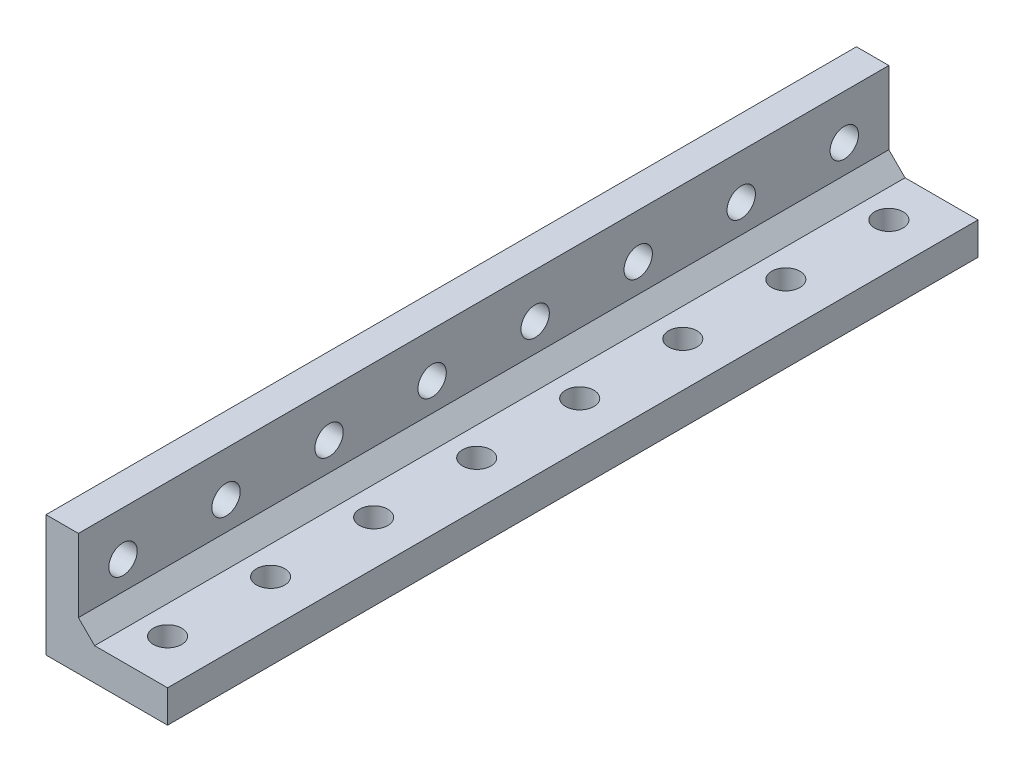
ISO-10303-21;
HEADER;
FILE_DESCRIPTION(('STEP AP214'),'2;1');
FILE_NAME('part.step','',(''),(''),'','','');
FILE_SCHEMA(('AUTOMOTIVE_DESIGN { 1 0 10303 214 1 1 1 1 }'));
ENDSEC;
DATA;
#1=APPLICATION_CONTEXT('core data for automotive mechanical design processes');
#2=APPLICATION_PROTOCOL_DEFINITION('international standard','automotive_design',2000,#1);
#3=PRODUCT_CONTEXT('',#1,'mechanical');
#4=PRODUCT('Part','Part','',(#3));
#5=PRODUCT_RELATED_PRODUCT_CATEGORY('part','',(#4));
#6=PRODUCT_DEFINITION_FORMATION('','',#4);
#7=PRODUCT_DEFINITION_CONTEXT('part definition',#1,'design');
#8=PRODUCT_DEFINITION('design','',#6,#7);
#9=PRODUCT_DEFINITION_SHAPE('','',#8);
#10=(LENGTH_UNIT() NAMED_UNIT(*) SI_UNIT(.MILLI.,.METRE.));
#11=(NAMED_UNIT(*) PLANE_ANGLE_UNIT() SI_UNIT($,.RADIAN.));
#12=(NAMED_UNIT(*) SI_UNIT($,.STERADIAN.) SOLID_ANGLE_UNIT());
#13=UNCERTAINTY_MEASURE_WITH_UNIT(LENGTH_MEASURE(1.E-05),#10,'distance_accuracy_value','');
#14=(GEOMETRIC_REPRESENTATION_CONTEXT(3) GLOBAL_UNCERTAINTY_ASSIGNED_CONTEXT((#13)) GLOBAL_UNIT_ASSIGNED_CONTEXT((#10,
#11,#12)) REPRESENTATION_CONTEXT('',''));
#15=CARTESIAN_POINT('',(0.,0.,0.));
#16=DIRECTION('',(0.,0.,1.));
#17=DIRECTION('',(1.,0.,0.));
#18=AXIS2_PLACEMENT_3D('',#15,#16,#17);
#19=CARTESIAN_POINT('',(9.50000000000002,-96.,5.50000000000001));
#20=DIRECTION('',(0.,1.,0.));
#21=DIRECTION('',(-1.,0.,0.));
#22=AXIS2_PLACEMENT_3D('',#19,#20,#21);
#23=CYLINDRICAL_SURFACE('',#22,1.75);
#24=CARTESIAN_POINT('',(9.5,4.,5.50000000000001));
#25=DIRECTION('',(0.,1.,0.));
#26=DIRECTION('',(-1.,0.,0.));
#27=AXIS2_PLACEMENT_3D('',#24,#25,#26);
#28=CIRCLE('',#27,1.75);
#29=CARTESIAN_POINT('',(7.75,4.,5.50000000000001));
#30=VERTEX_POINT('',#29);
#31=EDGE_CURVE('E226',#30,#30,#28,.T.);
#32=ORIENTED_EDGE('',*,*,#31,.T.);
#33=EDGE_LOOP('',(#32));
#34=FACE_BOUND('',#33,.T.);
#35=CARTESIAN_POINT('',(9.5,0.,5.50000000000001));
#36=DIRECTION('',(0.,1.,0.));
#37=DIRECTION('',(0.,0.,1.));
#38=AXIS2_PLACEMENT_3D('',#35,#36,#37);
#39=CIRCLE('',#38,1.75);
#40=CARTESIAN_POINT('',(9.5,0.,7.25000000000001));
#41=VERTEX_POINT('',#40);
#42=EDGE_CURVE('E230',#41,#41,#39,.T.);
#43=ORIENTED_EDGE('',*,*,#42,.F.);
#44=EDGE_LOOP('',(#43));
#45=FACE_BOUND('',#44,.T.);
#46=ADVANCED_FACE('F39',(#34,#45),#23,.F.);
#47=CARTESIAN_POINT('',(9.50000000000002,-96.,18.2142857142857));
#48=DIRECTION('',(0.,1.,0.));
#49=DIRECTION('',(-1.,0.,0.));
#50=AXIS2_PLACEMENT_3D('',#47,#48,#49);
#51=CYLINDRICAL_SURFACE('',#50,1.75);
#52=CARTESIAN_POINT('',(9.5,4.,18.2142857142857));
#53=DIRECTION('',(0.,1.,0.));
#54=DIRECTION('',(-1.,0.,0.));
#55=AXIS2_PLACEMENT_3D('',#52,#53,#54);
#56=CIRCLE('',#55,1.75);
#57=CARTESIAN_POINT('',(7.75,4.,18.2142857142857));
#58=VERTEX_POINT('',#57);
#59=EDGE_CURVE('E218',#58,#58,#56,.T.);
#60=ORIENTED_EDGE('',*,*,#59,.T.);
#61=EDGE_LOOP('',(#60));
#62=FACE_BOUND('',#61,.T.);
#63=CARTESIAN_POINT('',(9.5,0.,18.2142857142857));
#64=DIRECTION('',(0.,1.,0.));
#65=DIRECTION('',(0.,0.,1.));
#66=AXIS2_PLACEMENT_3D('',#63,#64,#65);
#67=CIRCLE('',#66,1.75);
#68=CARTESIAN_POINT('',(9.5,0.,19.9642857142857));
#69=VERTEX_POINT('',#68);
#70=EDGE_CURVE('E222',#69,#69,#67,.T.);
#71=ORIENTED_EDGE('',*,*,#70,.F.);
#72=EDGE_LOOP('',(#71));
#73=FACE_BOUND('',#72,.T.);
#74=ADVANCED_FACE('F349',(#62,#73),#51,.F.);
#75=CARTESIAN_POINT('',(9.50000000000002,-96.,30.9285714285714));
#76=DIRECTION('',(0.,1.,0.));
#77=DIRECTION('',(-1.,0.,0.));
#78=AXIS2_PLACEMENT_3D('',#75,#76,#77);
#79=CYLINDRICAL_SURFACE('',#78,1.75);
#80=CARTESIAN_POINT('',(9.5,4.,30.9285714285714));
#81=DIRECTION('',(0.,1.,0.));
#82=DIRECTION('',(-1.,0.,0.));
#83=AXIS2_PLACEMENT_3D('',#80,#81,#82);
#84=CIRCLE('',#83,1.75);
#85=CARTESIAN_POINT('',(7.75,4.,30.9285714285714));
#86=VERTEX_POINT('',#85);
#87=EDGE_CURVE('E210',#86,#86,#84,.T.);
#88=ORIENTED_EDGE('',*,*,#87,.T.);
#89=EDGE_LOOP('',(#88));
#90=FACE_BOUND('',#89,.T.);
#91=CARTESIAN_POINT('',(9.5,0.,30.9285714285714));
#92=DIRECTION('',(0.,1.,0.));
#93=DIRECTION('',(0.,0.,1.));
#94=AXIS2_PLACEMENT_3D('',#91,#92,#93);
#95=CIRCLE('',#94,1.75);
#96=CARTESIAN_POINT('',(9.5,0.,32.6785714285714));
#97=VERTEX_POINT('',#96);
#98=EDGE_CURVE('E214',#97,#97,#95,.T.);
#99=ORIENTED_EDGE('',*,*,#98,.F.);
#100=EDGE_LOOP('',(#99));
#101=FACE_BOUND('',#100,.T.);
#102=ADVANCED_FACE('F354',(#90,#101),#79,.F.);
#103=CARTESIAN_POINT('',(9.50000000000002,-96.,43.6428571428571));
#104=DIRECTION('',(0.,1.,0.));
#105=DIRECTION('',(-1.,0.,0.));
#106=AXIS2_PLACEMENT_3D('',#103,#104,#105);
#107=CYLINDRICAL_SURFACE('',#106,1.75);
#108=CARTESIAN_POINT('',(9.5,4.,43.6428571428571));
#109=DIRECTION('',(0.,1.,0.));
#110=DIRECTION('',(-1.,0.,0.));
#111=AXIS2_PLACEMENT_3D('',#108,#109,#110);
#112=CIRCLE('',#111,1.75);
#113=CARTESIAN_POINT('',(7.75,4.,43.6428571428571));
#114=VERTEX_POINT('',#113);
#115=EDGE_CURVE('E202',#114,#114,#112,.T.);
#116=ORIENTED_EDGE('',*,*,#115,.T.);
#117=EDGE_LOOP('',(#116));
#118=FACE_BOUND('',#117,.T.);
#119=CARTESIAN_POINT('',(9.5,0.,43.6428571428571));
#120=DIRECTION('',(0.,1.,0.));
#121=DIRECTION('',(0.,0.,1.));
#122=AXIS2_PLACEMENT_3D('',#119,#120,#121);
#123=CIRCLE('',#122,1.75);
#124=CARTESIAN_POINT('',(9.5,0.,45.3928571428571));
#125=VERTEX_POINT('',#124);
#126=EDGE_CURVE('E206',#125,#125,#123,.T.);
#127=ORIENTED_EDGE('',*,*,#126,.F.);
#128=EDGE_LOOP('',(#127));
#129=FACE_BOUND('',#128,.T.);
#130=ADVANCED_FACE('F361',(#118,#129),#107,.F.);
#131=CARTESIAN_POINT('',(9.50000000000002,-96.,56.3571428571428));
#132=DIRECTION('',(0.,1.,0.));
#133=DIRECTION('',(-1.,0.,0.));
#134=AXIS2_PLACEMENT_3D('',#131,#132,#133);
#135=CYLINDRICAL_SURFACE('',#134,1.75);
#136=CARTESIAN_POINT('',(9.5,4.,56.3571428571428));
#137=DIRECTION('',(0.,1.,0.));
#138=DIRECTION('',(-1.,0.,0.));
#139=AXIS2_PLACEMENT_3D('',#136,#137,#138);
#140=CIRCLE('',#139,1.75);
#141=CARTESIAN_POINT('',(7.75,4.,56.3571428571428));
#142=VERTEX_POINT('',#141);
#143=EDGE_CURVE('E194',#142,#142,#140,.T.);
#144=ORIENTED_EDGE('',*,*,#143,.T.);
#145=EDGE_LOOP('',(#144));
#146=FACE_BOUND('',#145,.T.);
#147=CARTESIAN_POINT('',(9.5,0.,56.3571428571428));
#148=DIRECTION('',(0.,1.,0.));
#149=DIRECTION('',(0.,0.,1.));
#150=AXIS2_PLACEMENT_3D('',#147,#148,#149);
#151=CIRCLE('',#150,1.75);
#152=CARTESIAN_POINT('',(9.5,0.,58.1071428571428));
#153=VERTEX_POINT('',#152);
#154=EDGE_CURVE('E198',#153,#153,#151,.T.);
#155=ORIENTED_EDGE('',*,*,#154,.F.);
#156=EDGE_LOOP('',(#155));
#157=FACE_BOUND('',#156,.T.);
#158=ADVANCED_FACE('F365',(#146,#157),#135,.F.);
#159=CARTESIAN_POINT('',(9.50000000000002,-96.,69.0714285714286));
#160=DIRECTION('',(0.,1.,0.));
#161=DIRECTION('',(-1.,0.,0.));
#162=AXIS2_PLACEMENT_3D('',#159,#160,#161);
#163=CYLINDRICAL_SURFACE('',#162,1.75);
#164=CARTESIAN_POINT('',(9.5,4.,69.0714285714286));
#165=DIRECTION('',(0.,1.,0.));
#166=DIRECTION('',(-1.,0.,0.));
#167=AXIS2_PLACEMENT_3D('',#164,#165,#166);
#168=CIRCLE('',#167,1.75);
#169=CARTESIAN_POINT('',(7.75,4.,69.0714285714286));
#170=VERTEX_POINT('',#169);
#171=EDGE_CURVE('E186',#170,#170,#168,.T.);
#172=ORIENTED_EDGE('',*,*,#171,.T.);
#173=EDGE_LOOP('',(#172));
#174=FACE_BOUND('',#173,.T.);
#175=CARTESIAN_POINT('',(9.5,0.,69.0714285714286));
#176=DIRECTION('',(0.,1.,0.));
#177=DIRECTION('',(0.,0.,1.));
#178=AXIS2_PLACEMENT_3D('',#175,#176,#177);
#179=CIRCLE('',#178,1.75);
#180=CARTESIAN_POINT('',(9.5,0.,70.8214285714286));
#181=VERTEX_POINT('',#180);
#182=EDGE_CURVE('E190',#181,#181,#179,.T.);
#183=ORIENTED_EDGE('',*,*,#182,.F.);
#184=EDGE_LOOP('',(#183));
#185=FACE_BOUND('',#184,.T.);
#186=ADVANCED_FACE('F369',(#174,#185),#163,.F.);
#187=CARTESIAN_POINT('',(-96.,9.5,5.50000000000001));
#188=DIRECTION('',(1.,0.,0.));
#189=DIRECTION('',(0.,0.,-1.));
#190=AXIS2_PLACEMENT_3D('',#187,#188,#189);
#191=CYLINDRICAL_SURFACE('',#190,1.75);
#192=CARTESIAN_POINT('',(4.,9.5,5.50000000000001));
#193=DIRECTION('',(1.,0.,0.));
#194=DIRECTION('',(0.,0.,-1.));
#195=AXIS2_PLACEMENT_3D('',#192,#193,#194);
#196=CIRCLE('',#195,1.75);
#197=CARTESIAN_POINT('',(4.,9.5,3.75000000000001));
#198=VERTEX_POINT('',#197);
#199=EDGE_CURVE('E178',#198,#198,#196,.T.);
#200=ORIENTED_EDGE('',*,*,#199,.T.);
#201=EDGE_LOOP('',(#200));
#202=FACE_BOUND('',#201,.T.);
#203=CARTESIAN_POINT('',(0.,9.5,5.50000000000001));
#204=DIRECTION('',(1.,0.,0.));
#205=DIRECTION('',(0.,0.,-1.));
#206=AXIS2_PLACEMENT_3D('',#203,#204,#205);
#207=CIRCLE('',#206,1.75);
#208=CARTESIAN_POINT('',(0.,9.5,3.75000000000001));
#209=VERTEX_POINT('',#208);
#210=EDGE_CURVE('E182',#209,#209,#207,.T.);
#211=ORIENTED_EDGE('',*,*,#210,.F.);
#212=EDGE_LOOP('',(#211));
#213=FACE_BOUND('',#212,.T.);
#214=ADVANCED_FACE('F373',(#202,#213),#191,.F.);
#215=CARTESIAN_POINT('',(-96.,9.5,18.2142857142857));
#216=DIRECTION('',(1.,0.,0.));
#217=DIRECTION('',(0.,0.,-1.));
#218=AXIS2_PLACEMENT_3D('',#215,#216,#217);
#219=CYLINDRICAL_SURFACE('',#218,1.75);
#220=CARTESIAN_POINT('',(4.,9.5,18.2142857142857));
#221=DIRECTION('',(1.,0.,0.));
#222=DIRECTION('',(0.,0.,-1.));
#223=AXIS2_PLACEMENT_3D('',#220,#221,#222);
#224=CIRCLE('',#223,1.75);
#225=CARTESIAN_POINT('',(4.,9.5,16.4642857142857));
#226=VERTEX_POINT('',#225);
#227=EDGE_CURVE('E170',#226,#226,#224,.T.);
#228=ORIENTED_EDGE('',*,*,#227,.T.);
#229=EDGE_LOOP('',(#228));
#230=FACE_BOUND('',#229,.T.);
#231=CARTESIAN_POINT('',(0.,9.5,18.2142857142857));
#232=DIRECTION('',(1.,0.,0.));
#233=DIRECTION('',(0.,0.,-1.));
#234=AXIS2_PLACEMENT_3D('',#231,#232,#233);
#235=CIRCLE('',#234,1.75);
#236=CARTESIAN_POINT('',(0.,9.5,16.4642857142857));
#237=VERTEX_POINT('',#236);
#238=EDGE_CURVE('E174',#237,#237,#235,.T.);
#239=ORIENTED_EDGE('',*,*,#238,.F.);
#240=EDGE_LOOP('',(#239));
#241=FACE_BOUND('',#240,.T.);
#242=ADVANCED_FACE('F377',(#230,#241),#219,.F.);
#243=CARTESIAN_POINT('',(-96.,9.5,30.9285714285714));
#244=DIRECTION('',(1.,0.,0.));
#245=DIRECTION('',(0.,0.,-1.));
#246=AXIS2_PLACEMENT_3D('',#243,#244,#245);
#247=CYLINDRICAL_SURFACE('',#246,1.75);
#248=CARTESIAN_POINT('',(4.,9.5,30.9285714285714));
#249=DIRECTION('',(1.,0.,0.));
#250=DIRECTION('',(0.,0.,-1.));
#251=AXIS2_PLACEMENT_3D('',#248,#249,#250);
#252=CIRCLE('',#251,1.75);
#253=CARTESIAN_POINT('',(4.,9.5,29.1785714285714));
#254=VERTEX_POINT('',#253);
#255=EDGE_CURVE('E162',#254,#254,#252,.T.);
#256=ORIENTED_EDGE('',*,*,#255,.T.);
#257=EDGE_LOOP('',(#256));
#258=FACE_BOUND('',#257,.T.);
#259=CARTESIAN_POINT('',(0.,9.5,30.9285714285714));
#260=DIRECTION('',(1.,0.,0.));
#261=DIRECTION('',(0.,0.,-1.));
#262=AXIS2_PLACEMENT_3D('',#259,#260,#261);
#263=CIRCLE('',#262,1.75);
#264=CARTESIAN_POINT('',(0.,9.5,29.1785714285714));
#265=VERTEX_POINT('',#264);
#266=EDGE_CURVE('E166',#265,#265,#263,.T.);
#267=ORIENTED_EDGE('',*,*,#266,.F.);
#268=EDGE_LOOP('',(#267));
#269=FACE_BOUND('',#268,.T.);
#270=ADVANCED_FACE('F381',(#258,#269),#247,.F.);
#271=CARTESIAN_POINT('',(-96.,9.5,43.6428571428571));
#272=DIRECTION('',(1.,0.,0.));
#273=DIRECTION('',(0.,0.,-1.));
#274=AXIS2_PLACEMENT_3D('',#271,#272,#273);
#275=CYLINDRICAL_SURFACE('',#274,1.75);
#276=CARTESIAN_POINT('',(4.,9.5,43.6428571428571));
#277=DIRECTION('',(1.,0.,0.));
#278=DIRECTION('',(0.,0.,-1.));
#279=AXIS2_PLACEMENT_3D('',#276,#277,#278);
#280=CIRCLE('',#279,1.75);
#281=CARTESIAN_POINT('',(4.,9.5,41.8928571428571));
#282=VERTEX_POINT('',#281);
#283=EDGE_CURVE('E154',#282,#282,#280,.T.);
#284=ORIENTED_EDGE('',*,*,#283,.T.);
#285=EDGE_LOOP('',(#284));
#286=FACE_BOUND('',#285,.T.);
#287=CARTESIAN_POINT('',(0.,9.5,43.6428571428571));
#288=DIRECTION('',(1.,0.,0.));
#289=DIRECTION('',(0.,0.,-1.));
#290=AXIS2_PLACEMENT_3D('',#287,#288,#289);
#291=CIRCLE('',#290,1.75);
#292=CARTESIAN_POINT('',(0.,9.5,41.8928571428571));
#293=VERTEX_POINT('',#292);
#294=EDGE_CURVE('E158',#293,#293,#291,.T.);
#295=ORIENTED_EDGE('',*,*,#294,.F.);
#296=EDGE_LOOP('',(#295));
#297=FACE_BOUND('',#296,.T.);
#298=ADVANCED_FACE('F385',(#286,#297),#275,.F.);
#299=CARTESIAN_POINT('',(-96.,9.5,56.3571428571428));
#300=DIRECTION('',(1.,0.,0.));
#301=DIRECTION('',(0.,0.,-1.));
#302=AXIS2_PLACEMENT_3D('',#299,#300,#301);
#303=CYLINDRICAL_SURFACE('',#302,1.75);
#304=CARTESIAN_POINT('',(4.,9.5,56.3571428571428));
#305=DIRECTION('',(1.,0.,0.));
#306=DIRECTION('',(0.,0.,-1.));
#307=AXIS2_PLACEMENT_3D('',#304,#305,#306);
#308=CIRCLE('',#307,1.75);
#309=CARTESIAN_POINT('',(4.,9.5,54.6071428571429));
#310=VERTEX_POINT('',#309);
#311=EDGE_CURVE('E146',#310,#310,#308,.T.);
#312=ORIENTED_EDGE('',*,*,#311,.T.);
#313=EDGE_LOOP('',(#312));
#314=FACE_BOUND('',#313,.T.);
#315=CARTESIAN_POINT('',(0.,9.5,56.3571428571428));
#316=DIRECTION('',(1.,0.,0.));
#317=DIRECTION('',(0.,0.,-1.));
#318=AXIS2_PLACEMENT_3D('',#315,#316,#317);
#319=CIRCLE('',#318,1.75);
#320=CARTESIAN_POINT('',(0.,9.5,54.6071428571429));
#321=VERTEX_POINT('',#320);
#322=EDGE_CURVE('E150',#321,#321,#319,.T.);
#323=ORIENTED_EDGE('',*,*,#322,.F.);
#324=EDGE_LOOP('',(#323));
#325=FACE_BOUND('',#324,.T.);
#326=ADVANCED_FACE('F345',(#314,#325),#303,.F.);
#327=CARTESIAN_POINT('',(-96.,9.5,69.0714285714286));
#328=DIRECTION('',(1.,0.,0.));
#329=DIRECTION('',(0.,0.,-1.));
#330=AXIS2_PLACEMENT_3D('',#327,#328,#329);
#331=CYLINDRICAL_SURFACE('',#330,1.75);
#332=CARTESIAN_POINT('',(4.,9.5,69.0714285714286));
#333=DIRECTION('',(1.,0.,0.));
#334=DIRECTION('',(0.,0.,-1.));
#335=AXIS2_PLACEMENT_3D('',#332,#333,#334);
#336=CIRCLE('',#335,1.75);
#337=CARTESIAN_POINT('',(4.,9.5,67.3214285714286));
#338=VERTEX_POINT('',#337);
#339=EDGE_CURVE('E127',#338,#338,#336,.T.);
#340=ORIENTED_EDGE('',*,*,#339,.T.);
#341=EDGE_LOOP('',(#340));
#342=FACE_BOUND('',#341,.T.);
#343=CARTESIAN_POINT('',(0.,9.5,69.0714285714286));
#344=DIRECTION('',(1.,0.,0.));
#345=DIRECTION('',(0.,0.,-1.));
#346=AXIS2_PLACEMENT_3D('',#343,#344,#345);
#347=CIRCLE('',#346,1.75);
#348=CARTESIAN_POINT('',(0.,9.5,67.3214285714286));
#349=VERTEX_POINT('',#348);
#350=EDGE_CURVE('E132',#349,#349,#347,.T.);
#351=ORIENTED_EDGE('',*,*,#350,.F.);
#352=EDGE_LOOP('',(#351));
#353=FACE_BOUND('',#352,.T.);
#354=ADVANCED_FACE('F337',(#342,#353),#331,.F.);
#355=CARTESIAN_POINT('',(0.,0.,100.));
#356=DIRECTION('',(0.,1.,0.));
#357=DIRECTION('',(0.,0.,1.));
#358=AXIS2_PLACEMENT_3D('',#355,#356,#357);
#359=PLANE('',#358);
#360=CARTESIAN_POINT('',(9.5,0.,81.7857142857143));
#361=DIRECTION('',(0.,1.,0.));
#362=DIRECTION('',(0.,0.,1.));
#363=AXIS2_PLACEMENT_3D('',#360,#361,#362);
#364=CIRCLE('',#363,1.75);
#365=CARTESIAN_POINT('',(9.5,0.,83.5357142857143));
#366=VERTEX_POINT('',#365);
#367=EDGE_CURVE('E312',#366,#366,#364,.T.);
#368=ORIENTED_EDGE('',*,*,#367,.T.);
#369=EDGE_LOOP('',(#368));
#370=FACE_BOUND('',#369,.T.);
#371=CARTESIAN_POINT('',(9.5,0.,94.5));
#372=DIRECTION('',(0.,1.,0.));
#373=DIRECTION('',(0.,0.,1.));
#374=AXIS2_PLACEMENT_3D('',#371,#372,#373);
#375=CIRCLE('',#374,1.75);
#376=CARTESIAN_POINT('',(9.5,0.,96.25));
#377=VERTEX_POINT('',#376);
#378=EDGE_CURVE('E304',#377,#377,#375,.T.);
#379=ORIENTED_EDGE('',*,*,#378,.T.);
#380=EDGE_LOOP('',(#379));
#381=FACE_BOUND('',#380,.T.);
#382=DIRECTION('',(1.,0.,0.));
#383=VECTOR('',#382,1.);
#384=CARTESIAN_POINT('',(0.,0.,0.));
#385=LINE('',#384,#383);
#386=CARTESIAN_POINT('',(0.,0.,0.));
#387=VERTEX_POINT('',#386);
#388=CARTESIAN_POINT('',(15.,0.,0.));
#389=VERTEX_POINT('',#388);
#390=EDGE_CURVE('E125',#387,#389,#385,.T.);
#391=ORIENTED_EDGE('',*,*,#390,.T.);
#392=DIRECTION('',(0.,0.,-1.));
#393=VECTOR('',#392,1.);
#394=CARTESIAN_POINT('',(15.,0.,100.));
#395=LINE('',#394,#393);
#396=CARTESIAN_POINT('',(15.,0.,100.));
#397=VERTEX_POINT('',#396);
#398=EDGE_CURVE('E103',#397,#389,#395,.T.);
#399=ORIENTED_EDGE('',*,*,#398,.F.);
#400=DIRECTION('',(1.,0.,0.));
#401=VECTOR('',#400,1.);
#402=CARTESIAN_POINT('',(0.,0.,100.));
#403=LINE('',#402,#401);
#404=CARTESIAN_POINT('',(0.,0.,100.));
#405=VERTEX_POINT('',#404);
#406=EDGE_CURVE('E110',#405,#397,#403,.T.);
#407=ORIENTED_EDGE('',*,*,#406,.F.);
#408=DIRECTION('',(0.,0.,-1.));
#409=VECTOR('',#408,1.);
#410=CARTESIAN_POINT('',(0.,0.,100.));
#411=LINE('',#410,#409);
#412=EDGE_CURVE('E267',#405,#387,#411,.T.);
#413=ORIENTED_EDGE('',*,*,#412,.T.);
#414=EDGE_LOOP('',(#391,#399,#407,#413));
#415=FACE_BOUND('',#414,.T.);
#416=ORIENTED_EDGE('',*,*,#182,.T.);
#417=EDGE_LOOP('',(#416));
#418=FACE_BOUND('',#417,.T.);
#419=ORIENTED_EDGE('',*,*,#154,.T.);
#420=EDGE_LOOP('',(#419));
#421=FACE_BOUND('',#420,.T.);
#422=ORIENTED_EDGE('',*,*,#126,.T.);
#423=EDGE_LOOP('',(#422));
#424=FACE_BOUND('',#423,.T.);
#425=ORIENTED_EDGE('',*,*,#98,.T.);
#426=EDGE_LOOP('',(#425));
#427=FACE_BOUND('',#426,.T.);
#428=ORIENTED_EDGE('',*,*,#70,.T.);
#429=EDGE_LOOP('',(#428));
#430=FACE_BOUND('',#429,.T.);
#431=ORIENTED_EDGE('',*,*,#42,.T.);
#432=EDGE_LOOP('',(#431));
#433=FACE_BOUND('',#432,.T.);
#434=ADVANCED_FACE('F122',(#370,#381,#415,#418,#421,#424,#427,#430,#433),#359,.F.);
#435=CARTESIAN_POINT('',(15.,0.,100.));
#436=DIRECTION('',(-1.,0.,0.));
#437=DIRECTION('',(0.,0.,1.));
#438=AXIS2_PLACEMENT_3D('',#435,#436,#437);
#439=PLANE('',#438);
#440=DIRECTION('',(0.,1.,0.));
#441=VECTOR('',#440,1.);
#442=CARTESIAN_POINT('',(15.,0.,0.));
#443=LINE('',#442,#441);
#444=CARTESIAN_POINT('',(15.,4.,0.));
#445=VERTEX_POINT('',#444);
#446=EDGE_CURVE('E261',#389,#445,#443,.T.);
#447=ORIENTED_EDGE('',*,*,#446,.T.);
#448=DIRECTION('',(0.,0.,-1.));
#449=VECTOR('',#448,1.);
#450=CARTESIAN_POINT('',(15.,4.,100.));
#451=LINE('',#450,#449);
#452=CARTESIAN_POINT('',(15.,4.,100.));
#453=VERTEX_POINT('',#452);
#454=EDGE_CURVE('E106',#453,#445,#451,.T.);
#455=ORIENTED_EDGE('',*,*,#454,.F.);
#456=DIRECTION('',(0.,1.,0.));
#457=VECTOR('',#456,1.);
#458=CARTESIAN_POINT('',(15.,0.,100.));
#459=LINE('',#458,#457);
#460=EDGE_CURVE('E99',#397,#453,#459,.T.);
#461=ORIENTED_EDGE('',*,*,#460,.F.);
#462=ORIENTED_EDGE('',*,*,#398,.T.);
#463=EDGE_LOOP('',(#447,#455,#461,#462));
#464=FACE_BOUND('',#463,.T.);
#465=ADVANCED_FACE('F101',(#464),#439,.F.);
#466=CARTESIAN_POINT('',(15.,4.,100.));
#467=DIRECTION('',(0.,-1.,0.));
#468=DIRECTION('',(1.,0.,0.));
#469=AXIS2_PLACEMENT_3D('',#466,#467,#468);
#470=PLANE('',#469);
#471=CARTESIAN_POINT('',(9.5,4.,81.7857142857143));
#472=DIRECTION('',(0.,1.,0.));
#473=DIRECTION('',(-1.,0.,0.));
#474=AXIS2_PLACEMENT_3D('',#471,#472,#473);
#475=CIRCLE('',#474,1.75);
#476=CARTESIAN_POINT('',(7.75,4.,81.7857142857143));
#477=VERTEX_POINT('',#476);
#478=EDGE_CURVE('E316',#477,#477,#475,.T.);
#479=ORIENTED_EDGE('',*,*,#478,.F.);
#480=EDGE_LOOP('',(#479));
#481=FACE_BOUND('',#480,.T.);
#482=CARTESIAN_POINT('',(9.5,4.,94.5));
#483=DIRECTION('',(0.,1.,0.));
#484=DIRECTION('',(-1.,0.,0.));
#485=AXIS2_PLACEMENT_3D('',#482,#483,#484);
#486=CIRCLE('',#485,1.75);
#487=CARTESIAN_POINT('',(7.75,4.,94.5));
#488=VERTEX_POINT('',#487);
#489=EDGE_CURVE('E308',#488,#488,#486,.T.);
#490=ORIENTED_EDGE('',*,*,#489,.F.);
#491=EDGE_LOOP('',(#490));
#492=FACE_BOUND('',#491,.T.);
#493=DIRECTION('',(-1.,0.,0.));
#494=VECTOR('',#493,1.);
#495=CARTESIAN_POINT('',(15.,4.,0.));
#496=LINE('',#495,#494);
#497=CARTESIAN_POINT('',(5.99999999999999,4.,0.));
#498=VERTEX_POINT('',#497);
#499=EDGE_CURVE('E256',#445,#498,#496,.T.);
#500=ORIENTED_EDGE('',*,*,#499,.T.);
#501=DIRECTION('',(0.,0.,1.));
#502=VECTOR('',#501,1.);
#503=CARTESIAN_POINT('',(5.99999999999999,4.,100.));
#504=LINE('',#503,#502);
#505=CARTESIAN_POINT('',(5.99999999999999,4.,100.));
#506=VERTEX_POINT('',#505);
#507=EDGE_CURVE('E55',#498,#506,#504,.T.);
#508=ORIENTED_EDGE('',*,*,#507,.T.);
#509=DIRECTION('',(-1.,0.,0.));
#510=VECTOR('',#509,1.);
#511=CARTESIAN_POINT('',(15.,4.,100.));
#512=LINE('',#511,#510);
#513=EDGE_CURVE('E109',#453,#506,#512,.T.);
#514=ORIENTED_EDGE('',*,*,#513,.F.);
#515=ORIENTED_EDGE('',*,*,#454,.T.);
#516=EDGE_LOOP('',(#500,#508,#514,#515));
#517=FACE_BOUND('',#516,.T.);
#518=ORIENTED_EDGE('',*,*,#171,.F.);
#519=EDGE_LOOP('',(#518));
#520=FACE_BOUND('',#519,.T.);
#521=ORIENTED_EDGE('',*,*,#143,.F.);
#522=EDGE_LOOP('',(#521));
#523=FACE_BOUND('',#522,.T.);
#524=ORIENTED_EDGE('',*,*,#115,.F.);
#525=EDGE_LOOP('',(#524));
#526=FACE_BOUND('',#525,.T.);
#527=ORIENTED_EDGE('',*,*,#87,.F.);
#528=EDGE_LOOP('',(#527));
#529=FACE_BOUND('',#528,.T.);
#530=ORIENTED_EDGE('',*,*,#59,.F.);
#531=EDGE_LOOP('',(#530));
#532=FACE_BOUND('',#531,.T.);
#533=ORIENTED_EDGE('',*,*,#31,.F.);
#534=EDGE_LOOP('',(#533));
#535=FACE_BOUND('',#534,.T.);
#536=ADVANCED_FACE('F289',(#481,#492,#517,#520,#523,#526,#529,#532,#535),#470,.F.);
#537=CARTESIAN_POINT('',(4.,4.,100.));
#538=DIRECTION('',(-1.,0.,0.));
#539=DIRECTION('',(0.,0.,1.));
#540=AXIS2_PLACEMENT_3D('',#537,#538,#539);
#541=PLANE('',#540);
#542=CARTESIAN_POINT('',(4.,9.5,81.7857142857143));
#543=DIRECTION('',(1.,0.,0.));
#544=DIRECTION('',(0.,0.,-1.));
#545=AXIS2_PLACEMENT_3D('',#542,#543,#544);
#546=CIRCLE('',#545,1.75);
#547=CARTESIAN_POINT('',(4.,9.5,80.0357142857143));
#548=VERTEX_POINT('',#547);
#549=EDGE_CURVE('E300',#548,#548,#546,.T.);
#550=ORIENTED_EDGE('',*,*,#549,.F.);
#551=EDGE_LOOP('',(#550));
#552=FACE_BOUND('',#551,.T.);
#553=CARTESIAN_POINT('',(4.,9.5,94.5));
#554=DIRECTION('',(1.,0.,0.));
#555=DIRECTION('',(0.,0.,-1.));
#556=AXIS2_PLACEMENT_3D('',#553,#554,#555);
#557=CIRCLE('',#556,1.75);
#558=CARTESIAN_POINT('',(4.,9.5,92.75));
#559=VERTEX_POINT('',#558);
#560=EDGE_CURVE('E141',#559,#559,#557,.T.);
#561=ORIENTED_EDGE('',*,*,#560,.F.);
#562=EDGE_LOOP('',(#561));
#563=FACE_BOUND('',#562,.T.);
#564=DIRECTION('',(0.,1.,0.));
#565=VECTOR('',#564,1.);
#566=CARTESIAN_POINT('',(4.,4.,100.));
#567=LINE('',#566,#565);
#568=CARTESIAN_POINT('',(4.,6.,100.));
#569=VERTEX_POINT('',#568);
#570=CARTESIAN_POINT('',(4.,15.,100.));
#571=VERTEX_POINT('',#570);
#572=EDGE_CURVE('E248',#569,#571,#567,.T.);
#573=ORIENTED_EDGE('',*,*,#572,.F.);
#574=DIRECTION('',(0.,0.,-1.));
#575=VECTOR('',#574,1.);
#576=CARTESIAN_POINT('',(4.,6.,0.));
#577=LINE('',#576,#575);
#578=CARTESIAN_POINT('',(4.,6.,0.));
#579=VERTEX_POINT('',#578);
#580=EDGE_CURVE('E234',#569,#579,#577,.T.);
#581=ORIENTED_EDGE('',*,*,#580,.T.);
#582=DIRECTION('',(0.,1.,0.));
#583=VECTOR('',#582,1.);
#584=CARTESIAN_POINT('',(4.,4.,0.));
#585=LINE('',#584,#583);
#586=CARTESIAN_POINT('',(4.,15.,0.));
#587=VERTEX_POINT('',#586);
#588=EDGE_CURVE('E246',#579,#587,#585,.T.);
#589=ORIENTED_EDGE('',*,*,#588,.T.);
#590=DIRECTION('',(0.,0.,-1.));
#591=VECTOR('',#590,1.);
#592=CARTESIAN_POINT('',(4.,15.,100.));
#593=LINE('',#592,#591);
#594=EDGE_CURVE('E134',#571,#587,#593,.T.);
#595=ORIENTED_EDGE('',*,*,#594,.F.);
#596=EDGE_LOOP('',(#573,#581,#589,#595));
#597=FACE_BOUND('',#596,.T.);
#598=ORIENTED_EDGE('',*,*,#339,.F.);
#599=EDGE_LOOP('',(#598));
#600=FACE_BOUND('',#599,.T.);
#601=ORIENTED_EDGE('',*,*,#311,.F.);
#602=EDGE_LOOP('',(#601));
#603=FACE_BOUND('',#602,.T.);
#604=ORIENTED_EDGE('',*,*,#283,.F.);
#605=EDGE_LOOP('',(#604));
#606=FACE_BOUND('',#605,.T.);
#607=ORIENTED_EDGE('',*,*,#255,.F.);
#608=EDGE_LOOP('',(#607));
#609=FACE_BOUND('',#608,.T.);
#610=ORIENTED_EDGE('',*,*,#227,.F.);
#611=EDGE_LOOP('',(#610));
#612=FACE_BOUND('',#611,.T.);
#613=ORIENTED_EDGE('',*,*,#199,.F.);
#614=EDGE_LOOP('',(#613));
#615=FACE_BOUND('',#614,.T.);
#616=ADVANCED_FACE('F243',(#552,#563,#597,#600,#603,#606,#609,#612,#615),#541,.F.);
#617=CARTESIAN_POINT('',(4.,15.,100.));
#618=DIRECTION('',(0.,-1.,0.));
#619=DIRECTION('',(0.,0.,-1.));
#620=AXIS2_PLACEMENT_3D('',#617,#618,#619);
#621=PLANE('',#620);
#622=DIRECTION('',(-1.,0.,0.));
#623=VECTOR('',#622,1.);
#624=CARTESIAN_POINT('',(4.,15.,0.));
#625=LINE('',#624,#623);
#626=CARTESIAN_POINT('',(0.,15.,0.));
#627=VERTEX_POINT('',#626);
#628=EDGE_CURVE('E254',#587,#627,#625,.T.);
#629=ORIENTED_EDGE('',*,*,#628,.T.);
#630=DIRECTION('',(0.,0.,-1.));
#631=VECTOR('',#630,1.);
#632=CARTESIAN_POINT('',(0.,15.,100.));
#633=LINE('',#632,#631);
#634=CARTESIAN_POINT('',(0.,15.,100.));
#635=VERTEX_POINT('',#634);
#636=EDGE_CURVE('E270',#635,#627,#633,.T.);
#637=ORIENTED_EDGE('',*,*,#636,.F.);
#638=DIRECTION('',(-1.,0.,0.));
#639=VECTOR('',#638,1.);
#640=CARTESIAN_POINT('',(4.,15.,100.));
#641=LINE('',#640,#639);
#642=EDGE_CURVE('E278',#571,#635,#641,.T.);
#643=ORIENTED_EDGE('',*,*,#642,.F.);
#644=ORIENTED_EDGE('',*,*,#594,.T.);
#645=EDGE_LOOP('',(#629,#637,#643,#644));
#646=FACE_BOUND('',#645,.T.);
#647=ADVANCED_FACE('F276',(#646),#621,.F.);
#648=CARTESIAN_POINT('',(0.,0.,100.));
#649=DIRECTION('',(1.,0.,0.));
#650=DIRECTION('',(0.,0.,-1.));
#651=AXIS2_PLACEMENT_3D('',#648,#649,#650);
#652=PLANE('',#651);
#653=CARTESIAN_POINT('',(0.,9.5,81.7857142857143));
#654=DIRECTION('',(1.,0.,0.));
#655=DIRECTION('',(0.,0.,-1.));
#656=AXIS2_PLACEMENT_3D('',#653,#654,#655);
#657=CIRCLE('',#656,1.75);
#658=CARTESIAN_POINT('',(0.,9.5,80.0357142857143));
#659=VERTEX_POINT('',#658);
#660=EDGE_CURVE('E296',#659,#659,#657,.T.);
#661=ORIENTED_EDGE('',*,*,#660,.T.);
#662=EDGE_LOOP('',(#661));
#663=FACE_BOUND('',#662,.T.);
#664=CARTESIAN_POINT('',(0.,9.5,94.5));
#665=DIRECTION('',(1.,0.,0.));
#666=DIRECTION('',(0.,0.,-1.));
#667=AXIS2_PLACEMENT_3D('',#664,#665,#666);
#668=CIRCLE('',#667,1.75);
#669=CARTESIAN_POINT('',(0.,9.5,92.75));
#670=VERTEX_POINT('',#669);
#671=EDGE_CURVE('E138',#670,#670,#668,.T.);
#672=ORIENTED_EDGE('',*,*,#671,.T.);
#673=EDGE_LOOP('',(#672));
#674=FACE_BOUND('',#673,.T.);
#675=DIRECTION('',(0.,-1.,0.));
#676=VECTOR('',#675,1.);
#677=CARTESIAN_POINT('',(0.,0.,0.));
#678=LINE('',#677,#676);
#679=EDGE_CURVE('E120',#627,#387,#678,.T.);
#680=ORIENTED_EDGE('',*,*,#679,.T.);
#681=ORIENTED_EDGE('',*,*,#412,.F.);
#682=DIRECTION('',(0.,-1.,0.));
#683=VECTOR('',#682,1.);
#684=CARTESIAN_POINT('',(0.,0.,100.));
#685=LINE('',#684,#683);
#686=EDGE_CURVE('E115',#635,#405,#685,.T.);
#687=ORIENTED_EDGE('',*,*,#686,.F.);
#688=ORIENTED_EDGE('',*,*,#636,.T.);
#689=EDGE_LOOP('',(#680,#681,#687,#688));
#690=FACE_BOUND('',#689,.T.);
#691=ORIENTED_EDGE('',*,*,#350,.T.);
#692=EDGE_LOOP('',(#691));
#693=FACE_BOUND('',#692,.T.);
#694=ORIENTED_EDGE('',*,*,#322,.T.);
#695=EDGE_LOOP('',(#694));
#696=FACE_BOUND('',#695,.T.);
#697=ORIENTED_EDGE('',*,*,#294,.T.);
#698=EDGE_LOOP('',(#697));
#699=FACE_BOUND('',#698,.T.);
#700=ORIENTED_EDGE('',*,*,#266,.T.);
#701=EDGE_LOOP('',(#700));
#702=FACE_BOUND('',#701,.T.);
#703=ORIENTED_EDGE('',*,*,#238,.T.);
#704=EDGE_LOOP('',(#703));
#705=FACE_BOUND('',#704,.T.);
#706=ORIENTED_EDGE('',*,*,#210,.T.);
#707=EDGE_LOOP('',(#706));
#708=FACE_BOUND('',#707,.T.);
#709=ADVANCED_FACE('F398',(#663,#674,#690,#693,#696,#699,#702,#705,#708),#652,.F.);
#710=CARTESIAN_POINT('',(0.,0.,100.));
#711=DIRECTION('',(0.,0.,1.));
#712=DIRECTION('',(1.,0.,0.));
#713=AXIS2_PLACEMENT_3D('',#710,#711,#712);
#714=PLANE('',#713);
#715=ORIENTED_EDGE('',*,*,#406,.T.);
#716=ORIENTED_EDGE('',*,*,#460,.T.);
#717=ORIENTED_EDGE('',*,*,#513,.T.);
#718=DIRECTION('',(0.707106781186545,-0.70710678118655,0.));
#719=VECTOR('',#718,1.);
#720=CARTESIAN_POINT('',(4.,6.,100.));
#721=LINE('',#720,#719);
#722=EDGE_CURVE('E11',#506,#569,#721,.F.);
#723=ORIENTED_EDGE('',*,*,#722,.T.);
#724=ORIENTED_EDGE('',*,*,#572,.T.);
#725=ORIENTED_EDGE('',*,*,#642,.T.);
#726=ORIENTED_EDGE('',*,*,#686,.T.);
#727=EDGE_LOOP('',(#715,#716,#717,#723,#724,#725,#726));
#728=FACE_BOUND('',#727,.T.);
#729=ADVANCED_FACE('F113',(#728),#714,.T.);
#730=CARTESIAN_POINT('',(0.,0.,0.));
#731=DIRECTION('',(0.,0.,1.));
#732=DIRECTION('',(1.,0.,0.));
#733=AXIS2_PLACEMENT_3D('',#730,#731,#732);
#734=PLANE('',#733);
#735=ORIENTED_EDGE('',*,*,#390,.F.);
#736=ORIENTED_EDGE('',*,*,#679,.F.);
#737=ORIENTED_EDGE('',*,*,#628,.F.);
#738=ORIENTED_EDGE('',*,*,#588,.F.);
#739=DIRECTION('',(-0.707106781186545,0.70710678118655,0.));
#740=VECTOR('',#739,1.);
#741=CARTESIAN_POINT('',(5.00000000000001,4.99999999999998,0.));
#742=LINE('',#741,#740);
#743=EDGE_CURVE('E48',#579,#498,#742,.F.);
#744=ORIENTED_EDGE('',*,*,#743,.T.);
#745=ORIENTED_EDGE('',*,*,#499,.F.);
#746=ORIENTED_EDGE('',*,*,#446,.F.);
#747=EDGE_LOOP('',(#735,#736,#737,#738,#744,#745,#746));
#748=FACE_BOUND('',#747,.T.);
#749=ADVANCED_FACE('F252',(#748),#734,.F.);
#750=CARTESIAN_POINT('',(-96.,9.5,94.5));
#751=DIRECTION('',(1.,0.,0.));
#752=DIRECTION('',(0.,0.,-1.));
#753=AXIS2_PLACEMENT_3D('',#750,#751,#752);
#754=CYLINDRICAL_SURFACE('',#753,1.75);
#755=ORIENTED_EDGE('',*,*,#560,.T.);
#756=EDGE_LOOP('',(#755));
#757=FACE_BOUND('',#756,.T.);
#758=ORIENTED_EDGE('',*,*,#671,.F.);
#759=EDGE_LOOP('',(#758));
#760=FACE_BOUND('',#759,.T.);
#761=ADVANCED_FACE('F431',(#757,#760),#754,.F.);
#762=CARTESIAN_POINT('',(-96.,9.5,81.7857142857143));
#763=DIRECTION('',(1.,0.,0.));
#764=DIRECTION('',(0.,0.,-1.));
#765=AXIS2_PLACEMENT_3D('',#762,#763,#764);
#766=CYLINDRICAL_SURFACE('',#765,1.75);
#767=ORIENTED_EDGE('',*,*,#549,.T.);
#768=EDGE_LOOP('',(#767));
#769=FACE_BOUND('',#768,.T.);
#770=ORIENTED_EDGE('',*,*,#660,.F.);
#771=EDGE_LOOP('',(#770));
#772=FACE_BOUND('',#771,.T.);
#773=ADVANCED_FACE('F332',(#769,#772),#766,.F.);
#774=CARTESIAN_POINT('',(9.50000000000002,-96.,94.5));
#775=DIRECTION('',(0.,1.,0.));
#776=DIRECTION('',(-1.,0.,0.));
#777=AXIS2_PLACEMENT_3D('',#774,#775,#776);
#778=CYLINDRICAL_SURFACE('',#777,1.75);
#779=ORIENTED_EDGE('',*,*,#489,.T.);
#780=EDGE_LOOP('',(#779));
#781=FACE_BOUND('',#780,.T.);
#782=ORIENTED_EDGE('',*,*,#378,.F.);
#783=EDGE_LOOP('',(#782));
#784=FACE_BOUND('',#783,.T.);
#785=ADVANCED_FACE('F329',(#781,#784),#778,.F.);
#786=CARTESIAN_POINT('',(9.50000000000002,-96.,81.7857142857143));
#787=DIRECTION('',(0.,1.,0.));
#788=DIRECTION('',(-1.,0.,0.));
#789=AXIS2_PLACEMENT_3D('',#786,#787,#788);
#790=CYLINDRICAL_SURFACE('',#789,1.75);
#791=ORIENTED_EDGE('',*,*,#478,.T.);
#792=EDGE_LOOP('',(#791));
#793=FACE_BOUND('',#792,.T.);
#794=ORIENTED_EDGE('',*,*,#367,.F.);
#795=EDGE_LOOP('',(#794));
#796=FACE_BOUND('',#795,.T.);
#797=ADVANCED_FACE('F321',(#793,#796),#790,.F.);
#798=CARTESIAN_POINT('',(4.,6.,100.));
#799=DIRECTION('',(0.70710678118655,0.707106781186545,0.));
#800=DIRECTION('',(0.,0.,1.));
#801=AXIS2_PLACEMENT_3D('',#798,#799,#800);
#802=PLANE('',#801);
#803=ORIENTED_EDGE('',*,*,#722,.F.);
#804=ORIENTED_EDGE('',*,*,#507,.F.);
#805=ORIENTED_EDGE('',*,*,#743,.F.);
#806=ORIENTED_EDGE('',*,*,#580,.F.);
#807=EDGE_LOOP('',(#803,#804,#805,#806));
#808=FACE_BOUND('',#807,.T.);
#809=ADVANCED_FACE('F41',(#808),#802,.T.);
#810=CLOSED_SHELL('',(#46,#74,#102,#130,#158,#186,#214,#242,#270,#298,#326,#354,#434,#465,#536,
#616,#647,#709,#729,#749,#761,#773,#785,#797,#809));
#811=MANIFOLD_SOLID_BREP('B2',#810);
#812=ADVANCED_BREP_SHAPE_REPRESENTATION('',(#18,#811),#14);
#813=SHAPE_DEFINITION_REPRESENTATION(#9,#812);
ENDSEC;
END-ISO-10303-21;
